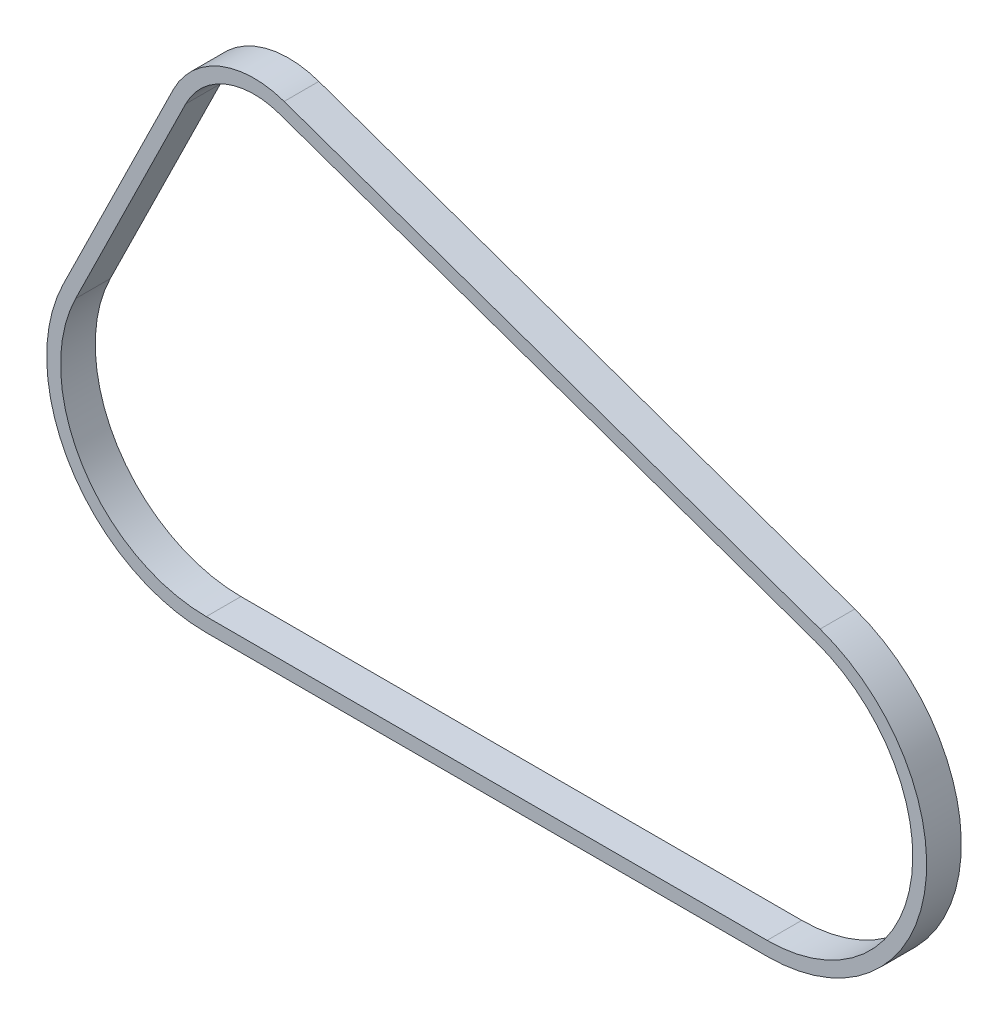
ISO-10303-21;
HEADER;
FILE_DESCRIPTION(('STEP AP214'),'2;1');
FILE_NAME('part.step','',(''),(''),'','','');
FILE_SCHEMA(('AUTOMOTIVE_DESIGN { 1 0 10303 214 1 1 1 1 }'));
ENDSEC;
DATA;
#1=APPLICATION_CONTEXT('core data for automotive mechanical design processes');
#2=APPLICATION_PROTOCOL_DEFINITION('international standard','automotive_design',2000,#1);
#3=PRODUCT_CONTEXT('',#1,'mechanical');
#4=PRODUCT('Part','Part','',(#3));
#5=PRODUCT_RELATED_PRODUCT_CATEGORY('part','',(#4));
#6=PRODUCT_DEFINITION_FORMATION('','',#4);
#7=PRODUCT_DEFINITION_CONTEXT('part definition',#1,'design');
#8=PRODUCT_DEFINITION('design','',#6,#7);
#9=PRODUCT_DEFINITION_SHAPE('','',#8);
#10=(LENGTH_UNIT() NAMED_UNIT(*) SI_UNIT(.MILLI.,.METRE.));
#11=(NAMED_UNIT(*) PLANE_ANGLE_UNIT() SI_UNIT($,.RADIAN.));
#12=(NAMED_UNIT(*) SI_UNIT($,.STERADIAN.) SOLID_ANGLE_UNIT());
#13=UNCERTAINTY_MEASURE_WITH_UNIT(LENGTH_MEASURE(1.E-05),#10,'distance_accuracy_value','');
#14=(GEOMETRIC_REPRESENTATION_CONTEXT(3) GLOBAL_UNCERTAINTY_ASSIGNED_CONTEXT((#13)) GLOBAL_UNIT_ASSIGNED_CONTEXT((#10,
#11,#12)) REPRESENTATION_CONTEXT('',''));
#15=CARTESIAN_POINT('',(0.,0.,0.));
#16=DIRECTION('',(0.,0.,1.));
#17=DIRECTION('',(1.,0.,0.));
#18=AXIS2_PLACEMENT_3D('',#15,#16,#17);
#19=CARTESIAN_POINT('',(0.,0.,-7.5));
#20=DIRECTION('',(0.,0.,1.));
#21=DIRECTION('',(1.,0.,0.));
#22=AXIS2_PLACEMENT_3D('',#19,#20,#21);
#23=CYLINDRICAL_SURFACE('',#22,39.);
#24=DIRECTION('',(0.,0.,1.));
#25=VECTOR('',#24,1.);
#26=CARTESIAN_POINT('',(-34.9896953567764,17.2255977788865,-7.5));
#27=LINE('',#26,#25);
#28=CARTESIAN_POINT('',(-34.9896953567764,17.2255977788865,-7.5));
#29=VERTEX_POINT('',#28);
#30=CARTESIAN_POINT('',(-34.9896953567764,17.2255977788865,7.5));
#31=VERTEX_POINT('',#30);
#32=EDGE_CURVE('E110',#29,#31,#27,.T.);
#33=ORIENTED_EDGE('',*,*,#32,.T.);
#34=CARTESIAN_POINT('',(0.,0.,7.5));
#35=DIRECTION('',(0.,0.,1.));
#36=DIRECTION('',(1.,0.,0.));
#37=AXIS2_PLACEMENT_3D('',#34,#35,#36);
#38=CIRCLE('',#37,39.);
#39=CARTESIAN_POINT('',(12.965481958583,36.78173837085,7.49999999999999));
#40=VERTEX_POINT('',#39);
#41=EDGE_CURVE('E233',#40,#31,#38,.T.);
#42=ORIENTED_EDGE('',*,*,#41,.F.);
#43=DIRECTION('',(0.,0.,1.));
#44=VECTOR('',#43,1.);
#45=CARTESIAN_POINT('',(12.965481958583,36.78173837085,-7.50000000000001));
#46=LINE('',#45,#44);
#47=CARTESIAN_POINT('',(12.965481958583,36.78173837085,-7.50000000000001));
#48=VERTEX_POINT('',#47);
#49=EDGE_CURVE('E12',#48,#40,#46,.T.);
#50=ORIENTED_EDGE('',*,*,#49,.F.);
#51=CARTESIAN_POINT('',(0.,0.,-7.5));
#52=DIRECTION('',(0.,0.,1.));
#53=DIRECTION('',(1.,0.,0.));
#54=AXIS2_PLACEMENT_3D('',#51,#52,#53);
#55=CIRCLE('',#54,39.);
#56=EDGE_CURVE('E264',#48,#29,#55,.T.);
#57=ORIENTED_EDGE('',*,*,#56,.T.);
#58=EDGE_LOOP('',(#33,#42,#50,#57));
#59=FACE_BOUND('',#58,.T.);
#60=ADVANCED_FACE('F107',(#59),#23,.T.);
#61=CARTESIAN_POINT('',(244.758005067254,-44.9246167284962,-7.5));
#62=DIRECTION('',(0.332448255348283,0.943121496688461,0.));
#63=DIRECTION('',(-0.943121496688461,0.332448255348283,0.));
#64=AXIS2_PLACEMENT_3D('',#61,#62,#63);
#65=PLANE('',#64);
#66=ORIENTED_EDGE('',*,*,#49,.T.);
#67=DIRECTION('',(-0.943121496688461,0.332448255348283,0.));
#68=VECTOR('',#67,1.);
#69=CARTESIAN_POINT('',(244.758005067254,-44.9246167284962,7.5));
#70=LINE('',#69,#68);
#71=CARTESIAN_POINT('',(244.758005067254,-44.9246167284962,7.5));
#72=VERTEX_POINT('',#71);
#73=EDGE_CURVE('E248',#72,#40,#70,.T.);
#74=ORIENTED_EDGE('',*,*,#73,.F.);
#75=DIRECTION('',(0.,0.,1.));
#76=VECTOR('',#75,1.);
#77=CARTESIAN_POINT('',(244.758005067254,-44.9246167284962,-7.5));
#78=LINE('',#77,#76);
#79=CARTESIAN_POINT('',(244.758005067254,-44.9246167284962,-7.5));
#80=VERTEX_POINT('',#79);
#81=EDGE_CURVE('E115',#80,#72,#78,.T.);
#82=ORIENTED_EDGE('',*,*,#81,.F.);
#83=DIRECTION('',(-0.943121496688461,0.332448255348283,0.));
#84=VECTOR('',#83,1.);
#85=CARTESIAN_POINT('',(244.758005067254,-44.9246167284962,-7.5));
#86=LINE('',#85,#84);
#87=EDGE_CURVE('E285',#80,#48,#86,.T.);
#88=ORIENTED_EDGE('',*,*,#87,.T.);
#89=EDGE_LOOP('',(#66,#74,#82,#88));
#90=FACE_BOUND('',#89,.T.);
#91=ADVANCED_FACE('F302',(#90),#65,.T.);
#92=CARTESIAN_POINT('',(221.819075448222,-110.,-7.5));
#93=DIRECTION('',(0.,0.,1.));
#94=DIRECTION('',(1.,0.,0.));
#95=AXIS2_PLACEMENT_3D('',#92,#93,#94);
#96=CYLINDRICAL_SURFACE('',#95,69.);
#97=ORIENTED_EDGE('',*,*,#81,.T.);
#98=CARTESIAN_POINT('',(221.819075448222,-110.,7.5));
#99=DIRECTION('',(0.,0.,1.));
#100=DIRECTION('',(1.,0.,0.));
#101=AXIS2_PLACEMENT_3D('',#98,#99,#100);
#102=CIRCLE('',#101,69.);
#103=CARTESIAN_POINT('',(221.819075448222,-179.,7.5));
#104=VERTEX_POINT('',#103);
#105=EDGE_CURVE('E245',#104,#72,#102,.T.);
#106=ORIENTED_EDGE('',*,*,#105,.F.);
#107=DIRECTION('',(0.,0.,1.));
#108=VECTOR('',#107,1.);
#109=CARTESIAN_POINT('',(221.819075448222,-179.,-7.5));
#110=LINE('',#109,#108);
#111=CARTESIAN_POINT('',(221.819075448222,-179.,-7.5));
#112=VERTEX_POINT('',#111);
#113=EDGE_CURVE('E289',#112,#104,#110,.T.);
#114=ORIENTED_EDGE('',*,*,#113,.F.);
#115=CARTESIAN_POINT('',(221.819075448222,-110.,-7.5));
#116=DIRECTION('',(0.,0.,1.));
#117=DIRECTION('',(1.,0.,0.));
#118=AXIS2_PLACEMENT_3D('',#115,#116,#117);
#119=CIRCLE('',#118,69.);
#120=EDGE_CURVE('E282',#112,#80,#119,.T.);
#121=ORIENTED_EDGE('',*,*,#120,.T.);
#122=EDGE_LOOP('',(#97,#106,#114,#121));
#123=FACE_BOUND('',#122,.T.);
#124=ADVANCED_FACE('F315',(#123),#96,.T.);
#125=CARTESIAN_POINT('',(-20.7151205029609,-179.,-7.5));
#126=DIRECTION('',(0.,-1.,0.));
#127=DIRECTION('',(0.,0.,-1.));
#128=AXIS2_PLACEMENT_3D('',#125,#126,#127);
#129=PLANE('',#128);
#130=ORIENTED_EDGE('',*,*,#113,.T.);
#131=DIRECTION('',(1.,0.,0.));
#132=VECTOR('',#131,1.);
#133=CARTESIAN_POINT('',(-20.7151205029609,-179.,7.5));
#134=LINE('',#133,#132);
#135=CARTESIAN_POINT('',(-20.7151205029609,-179.,7.5));
#136=VERTEX_POINT('',#135);
#137=EDGE_CURVE('E242',#136,#104,#134,.T.);
#138=ORIENTED_EDGE('',*,*,#137,.F.);
#139=DIRECTION('',(0.,0.,1.));
#140=VECTOR('',#139,1.);
#141=CARTESIAN_POINT('',(-20.7151205029609,-179.,-7.5));
#142=LINE('',#141,#140);
#143=CARTESIAN_POINT('',(-20.7151205029609,-179.,-7.5));
#144=VERTEX_POINT('',#143);
#145=EDGE_CURVE('E291',#144,#136,#142,.T.);
#146=ORIENTED_EDGE('',*,*,#145,.F.);
#147=DIRECTION('',(1.,0.,0.));
#148=VECTOR('',#147,1.);
#149=CARTESIAN_POINT('',(-20.7151205029609,-179.,-7.5));
#150=LINE('',#149,#148);
#151=EDGE_CURVE('E279',#144,#112,#150,.T.);
#152=ORIENTED_EDGE('',*,*,#151,.T.);
#153=EDGE_LOOP('',(#130,#138,#146,#152));
#154=FACE_BOUND('',#153,.T.);
#155=ADVANCED_FACE('F313',(#154),#129,.T.);
#156=CARTESIAN_POINT('',(-20.7151205029609,-110.,-7.5));
#157=DIRECTION('',(0.,0.,1.));
#158=DIRECTION('',(1.,0.,0.));
#159=AXIS2_PLACEMENT_3D('',#156,#157,#158);
#160=CYLINDRICAL_SURFACE('',#159,69.);
#161=ORIENTED_EDGE('',*,*,#145,.T.);
#162=CARTESIAN_POINT('',(-20.7151205029609,-110.,7.5));
#163=DIRECTION('',(0.,0.,1.));
#164=DIRECTION('',(1.,0.,0.));
#165=AXIS2_PLACEMENT_3D('',#162,#163,#164);
#166=CIRCLE('',#165,69.);
#167=CARTESIAN_POINT('',(-82.6199661341808,-79.5239423912008,7.5));
#168=VERTEX_POINT('',#167);
#169=EDGE_CURVE('E239',#168,#136,#166,.T.);
#170=ORIENTED_EDGE('',*,*,#169,.F.);
#171=DIRECTION('',(0.,0.,1.));
#172=VECTOR('',#171,1.);
#173=CARTESIAN_POINT('',(-82.6199661341808,-79.5239423912008,-7.5));
#174=LINE('',#173,#172);
#175=CARTESIAN_POINT('',(-82.6199661341808,-79.5239423912008,-7.5));
#176=VERTEX_POINT('',#175);
#177=EDGE_CURVE('E292',#176,#168,#174,.T.);
#178=ORIENTED_EDGE('',*,*,#177,.F.);
#179=CARTESIAN_POINT('',(-20.7151205029609,-110.,-7.5));
#180=DIRECTION('',(0.,0.,1.));
#181=DIRECTION('',(1.,0.,0.));
#182=AXIS2_PLACEMENT_3D('',#179,#180,#181);
#183=CIRCLE('',#182,69.);
#184=EDGE_CURVE('E276',#176,#144,#183,.T.);
#185=ORIENTED_EDGE('',*,*,#184,.T.);
#186=EDGE_LOOP('',(#161,#170,#178,#185));
#187=FACE_BOUND('',#186,.T.);
#188=ADVANCED_FACE('F310',(#187),#160,.T.);
#189=CARTESIAN_POINT('',(-34.9896953567764,17.2255977788865,-7.5));
#190=DIRECTION('',(-0.897171675814779,0.441681994330423,0.));
#191=DIRECTION('',(-0.441681994330424,-0.89717167581478,0.));
#192=AXIS2_PLACEMENT_3D('',#189,#190,#191);
#193=PLANE('',#192);
#194=ORIENTED_EDGE('',*,*,#177,.T.);
#195=DIRECTION('',(-0.441681994330424,-0.89717167581478,0.));
#196=VECTOR('',#195,1.);
#197=CARTESIAN_POINT('',(-34.9896953567764,17.2255977788865,7.5));
#198=LINE('',#197,#196);
#199=EDGE_CURVE('E236',#31,#168,#198,.T.);
#200=ORIENTED_EDGE('',*,*,#199,.F.);
#201=ORIENTED_EDGE('',*,*,#32,.F.);
#202=DIRECTION('',(-0.441681994330424,-0.89717167581478,0.));
#203=VECTOR('',#202,1.);
#204=CARTESIAN_POINT('',(-34.9896953567764,17.2255977788865,-7.5));
#205=LINE('',#204,#203);
#206=EDGE_CURVE('E273',#29,#176,#205,.T.);
#207=ORIENTED_EDGE('',*,*,#206,.T.);
#208=EDGE_LOOP('',(#194,#200,#201,#207));
#209=FACE_BOUND('',#208,.T.);
#210=ADVANCED_FACE('F296',(#209),#193,.T.);
#211=CARTESIAN_POINT('',(0.,0.,-7.5));
#212=DIRECTION('',(0.,0.,1.));
#213=DIRECTION('',(1.,0.,0.));
#214=AXIS2_PLACEMENT_3D('',#211,#212,#213);
#215=PLANE('',#214);
#216=DIRECTION('',(-0.943121496688461,0.332448255348283,0.));
#217=VECTOR('',#216,1.);
#218=CARTESIAN_POINT('',(242.763315535164,-50.5833457086269,-7.5));
#219=LINE('',#218,#217);
#220=CARTESIAN_POINT('',(242.763315535164,-50.5833457086269,-7.5));
#221=VERTEX_POINT('',#220);
#222=CARTESIAN_POINT('',(10.9707924264934,31.1230093907192,-7.5));
#223=VERTEX_POINT('',#222);
#224=EDGE_CURVE('E208',#221,#223,#219,.T.);
#225=ORIENTED_EDGE('',*,*,#224,.T.);
#226=CARTESIAN_POINT('',(0.,0.,-7.5));
#227=DIRECTION('',(0.,0.,1.));
#228=DIRECTION('',(1.,0.,0.));
#229=AXIS2_PLACEMENT_3D('',#226,#227,#228);
#230=CIRCLE('',#229,33.);
#231=CARTESIAN_POINT('',(-29.6066653018877,14.575505812904,-7.5));
#232=VERTEX_POINT('',#231);
#233=EDGE_CURVE('E251',#223,#232,#230,.T.);
#234=ORIENTED_EDGE('',*,*,#233,.T.);
#235=DIRECTION('',(-0.441681994330423,-0.89717167581478,0.));
#236=VECTOR('',#235,1.);
#237=CARTESIAN_POINT('',(-29.6066653018877,14.575505812904,-7.5));
#238=LINE('',#237,#236);
#239=CARTESIAN_POINT('',(-77.2369360792921,-82.1740343571833,-7.5));
#240=VERTEX_POINT('',#239);
#241=EDGE_CURVE('E203',#232,#240,#238,.T.);
#242=ORIENTED_EDGE('',*,*,#241,.T.);
#243=CARTESIAN_POINT('',(-20.7151205029609,-110.,-7.5));
#244=DIRECTION('',(0.,0.,1.));
#245=DIRECTION('',(1.,0.,0.));
#246=AXIS2_PLACEMENT_3D('',#243,#244,#245);
#247=CIRCLE('',#246,63.);
#248=CARTESIAN_POINT('',(-20.7151205029609,-173.,-7.5));
#249=VERTEX_POINT('',#248);
#250=EDGE_CURVE('E123',#240,#249,#247,.T.);
#251=ORIENTED_EDGE('',*,*,#250,.T.);
#252=DIRECTION('',(1.,0.,0.));
#253=VECTOR('',#252,1.);
#254=CARTESIAN_POINT('',(-20.7151205029609,-173.,-7.5));
#255=LINE('',#254,#253);
#256=CARTESIAN_POINT('',(221.819075448222,-173.,-7.5));
#257=VERTEX_POINT('',#256);
#258=EDGE_CURVE('E255',#249,#257,#255,.T.);
#259=ORIENTED_EDGE('',*,*,#258,.T.);
#260=CARTESIAN_POINT('',(221.819075448222,-110.,-7.5));
#261=DIRECTION('',(0.,0.,1.));
#262=DIRECTION('',(1.,0.,0.));
#263=AXIS2_PLACEMENT_3D('',#260,#261,#262);
#264=CIRCLE('',#263,63.);
#265=EDGE_CURVE('E258',#257,#221,#264,.T.);
#266=ORIENTED_EDGE('',*,*,#265,.T.);
#267=EDGE_LOOP('',(#225,#234,#242,#251,#259,#266));
#268=FACE_BOUND('',#267,.T.);
#269=ORIENTED_EDGE('',*,*,#56,.F.);
#270=ORIENTED_EDGE('',*,*,#87,.F.);
#271=ORIENTED_EDGE('',*,*,#120,.F.);
#272=ORIENTED_EDGE('',*,*,#151,.F.);
#273=ORIENTED_EDGE('',*,*,#184,.F.);
#274=ORIENTED_EDGE('',*,*,#206,.F.);
#275=EDGE_LOOP('',(#269,#270,#271,#272,#273,#274));
#276=FACE_BOUND('',#275,.T.);
#277=ADVANCED_FACE('F306',(#268,#276),#215,.F.);
#278=CARTESIAN_POINT('',(0.,0.,-7.5));
#279=DIRECTION('',(0.,0.,1.));
#280=DIRECTION('',(1.,0.,0.));
#281=AXIS2_PLACEMENT_3D('',#278,#279,#280);
#282=CYLINDRICAL_SURFACE('',#281,33.);
#283=DIRECTION('',(0.,0.,1.));
#284=VECTOR('',#283,1.);
#285=CARTESIAN_POINT('',(10.9707924264934,31.1230093907192,-7.5));
#286=LINE('',#285,#284);
#287=CARTESIAN_POINT('',(10.9707924264934,31.1230093907192,7.5));
#288=VERTEX_POINT('',#287);
#289=EDGE_CURVE('E213',#223,#288,#286,.T.);
#290=ORIENTED_EDGE('',*,*,#289,.T.);
#291=CARTESIAN_POINT('',(0.,0.,7.5));
#292=DIRECTION('',(0.,0.,1.));
#293=DIRECTION('',(1.,0.,0.));
#294=AXIS2_PLACEMENT_3D('',#291,#292,#293);
#295=CIRCLE('',#294,33.);
#296=CARTESIAN_POINT('',(-29.6066653018877,14.575505812904,7.5));
#297=VERTEX_POINT('',#296);
#298=EDGE_CURVE('E211',#288,#297,#295,.T.);
#299=ORIENTED_EDGE('',*,*,#298,.T.);
#300=DIRECTION('',(0.,0.,1.));
#301=VECTOR('',#300,1.);
#302=CARTESIAN_POINT('',(-29.6066653018877,14.575505812904,-7.5));
#303=LINE('',#302,#301);
#304=EDGE_CURVE('E196',#232,#297,#303,.T.);
#305=ORIENTED_EDGE('',*,*,#304,.F.);
#306=ORIENTED_EDGE('',*,*,#233,.F.);
#307=EDGE_LOOP('',(#290,#299,#305,#306));
#308=FACE_BOUND('',#307,.T.);
#309=ADVANCED_FACE('F212',(#308),#282,.F.);
#310=CARTESIAN_POINT('',(242.763315535164,-50.5833457086269,-7.5));
#311=DIRECTION('',(0.332448255348283,0.943121496688461,0.));
#312=DIRECTION('',(-0.943121496688461,0.332448255348283,0.));
#313=AXIS2_PLACEMENT_3D('',#310,#311,#312);
#314=PLANE('',#313);
#315=DIRECTION('',(0.,0.,1.));
#316=VECTOR('',#315,1.);
#317=CARTESIAN_POINT('',(242.763315535164,-50.5833457086269,-7.5));
#318=LINE('',#317,#316);
#319=CARTESIAN_POINT('',(242.763315535164,-50.5833457086269,7.5));
#320=VERTEX_POINT('',#319);
#321=EDGE_CURVE('E265',#221,#320,#318,.T.);
#322=ORIENTED_EDGE('',*,*,#321,.T.);
#323=DIRECTION('',(-0.943121496688461,0.332448255348283,0.));
#324=VECTOR('',#323,1.);
#325=CARTESIAN_POINT('',(242.763315535164,-50.5833457086269,7.5));
#326=LINE('',#325,#324);
#327=EDGE_CURVE('E231',#320,#288,#326,.T.);
#328=ORIENTED_EDGE('',*,*,#327,.T.);
#329=ORIENTED_EDGE('',*,*,#289,.F.);
#330=ORIENTED_EDGE('',*,*,#224,.F.);
#331=EDGE_LOOP('',(#322,#328,#329,#330));
#332=FACE_BOUND('',#331,.T.);
#333=ADVANCED_FACE('F374',(#332),#314,.F.);
#334=CARTESIAN_POINT('',(221.819075448222,-110.,-7.5));
#335=DIRECTION('',(0.,0.,1.));
#336=DIRECTION('',(1.,0.,0.));
#337=AXIS2_PLACEMENT_3D('',#334,#335,#336);
#338=CYLINDRICAL_SURFACE('',#337,63.);
#339=DIRECTION('',(0.,0.,1.));
#340=VECTOR('',#339,1.);
#341=CARTESIAN_POINT('',(221.819075448222,-173.,-7.5));
#342=LINE('',#341,#340);
#343=CARTESIAN_POINT('',(221.819075448222,-173.,7.5));
#344=VERTEX_POINT('',#343);
#345=EDGE_CURVE('E267',#257,#344,#342,.T.);
#346=ORIENTED_EDGE('',*,*,#345,.T.);
#347=CARTESIAN_POINT('',(221.819075448222,-110.,7.5));
#348=DIRECTION('',(0.,0.,1.));
#349=DIRECTION('',(1.,0.,0.));
#350=AXIS2_PLACEMENT_3D('',#347,#348,#349);
#351=CIRCLE('',#350,63.);
#352=EDGE_CURVE('E228',#344,#320,#351,.T.);
#353=ORIENTED_EDGE('',*,*,#352,.T.);
#354=ORIENTED_EDGE('',*,*,#321,.F.);
#355=ORIENTED_EDGE('',*,*,#265,.F.);
#356=EDGE_LOOP('',(#346,#353,#354,#355));
#357=FACE_BOUND('',#356,.T.);
#358=ADVANCED_FACE('F383',(#357),#338,.F.);
#359=CARTESIAN_POINT('',(-20.7151205029609,-173.,-7.5));
#360=DIRECTION('',(0.,-1.,0.));
#361=DIRECTION('',(0.,0.,-1.));
#362=AXIS2_PLACEMENT_3D('',#359,#360,#361);
#363=PLANE('',#362);
#364=DIRECTION('',(0.,0.,1.));
#365=VECTOR('',#364,1.);
#366=CARTESIAN_POINT('',(-20.7151205029609,-173.,-7.5));
#367=LINE('',#366,#365);
#368=CARTESIAN_POINT('',(-20.7151205029609,-173.,7.5));
#369=VERTEX_POINT('',#368);
#370=EDGE_CURVE('E269',#249,#369,#367,.T.);
#371=ORIENTED_EDGE('',*,*,#370,.T.);
#372=DIRECTION('',(1.,0.,0.));
#373=VECTOR('',#372,1.);
#374=CARTESIAN_POINT('',(-20.7151205029609,-173.,7.5));
#375=LINE('',#374,#373);
#376=EDGE_CURVE('E223',#369,#344,#375,.T.);
#377=ORIENTED_EDGE('',*,*,#376,.T.);
#378=ORIENTED_EDGE('',*,*,#345,.F.);
#379=ORIENTED_EDGE('',*,*,#258,.F.);
#380=EDGE_LOOP('',(#371,#377,#378,#379));
#381=FACE_BOUND('',#380,.T.);
#382=ADVANCED_FACE('F393',(#381),#363,.F.);
#383=CARTESIAN_POINT('',(-20.7151205029609,-110.,-7.5));
#384=DIRECTION('',(0.,0.,1.));
#385=DIRECTION('',(1.,0.,0.));
#386=AXIS2_PLACEMENT_3D('',#383,#384,#385);
#387=CYLINDRICAL_SURFACE('',#386,63.);
#388=DIRECTION('',(0.,0.,1.));
#389=VECTOR('',#388,1.);
#390=CARTESIAN_POINT('',(-77.2369360792921,-82.1740343571833,-7.5));
#391=LINE('',#390,#389);
#392=CARTESIAN_POINT('',(-77.2369360792921,-82.1740343571833,7.5));
#393=VERTEX_POINT('',#392);
#394=EDGE_CURVE('E207',#240,#393,#391,.T.);
#395=ORIENTED_EDGE('',*,*,#394,.T.);
#396=CARTESIAN_POINT('',(-20.7151205029609,-110.,7.5));
#397=DIRECTION('',(0.,0.,1.));
#398=DIRECTION('',(1.,0.,0.));
#399=AXIS2_PLACEMENT_3D('',#396,#397,#398);
#400=CIRCLE('',#399,63.);
#401=EDGE_CURVE('E221',#393,#369,#400,.T.);
#402=ORIENTED_EDGE('',*,*,#401,.T.);
#403=ORIENTED_EDGE('',*,*,#370,.F.);
#404=ORIENTED_EDGE('',*,*,#250,.F.);
#405=EDGE_LOOP('',(#395,#402,#403,#404));
#406=FACE_BOUND('',#405,.T.);
#407=ADVANCED_FACE('F403',(#406),#387,.F.);
#408=CARTESIAN_POINT('',(-29.6066653018877,14.575505812904,-7.5));
#409=DIRECTION('',(-0.89717167581478,0.441681994330423,0.));
#410=DIRECTION('',(-0.441681994330423,-0.89717167581478,0.));
#411=AXIS2_PLACEMENT_3D('',#408,#409,#410);
#412=PLANE('',#411);
#413=ORIENTED_EDGE('',*,*,#304,.T.);
#414=DIRECTION('',(-0.441681994330423,-0.89717167581478,0.));
#415=VECTOR('',#414,1.);
#416=CARTESIAN_POINT('',(-29.6066653018877,14.575505812904,7.5));
#417=LINE('',#416,#415);
#418=EDGE_CURVE('E200',#297,#393,#417,.T.);
#419=ORIENTED_EDGE('',*,*,#418,.T.);
#420=ORIENTED_EDGE('',*,*,#394,.F.);
#421=ORIENTED_EDGE('',*,*,#241,.F.);
#422=EDGE_LOOP('',(#413,#419,#420,#421));
#423=FACE_BOUND('',#422,.T.);
#424=ADVANCED_FACE('F198',(#423),#412,.F.);
#425=CARTESIAN_POINT('',(0.,0.,7.5));
#426=DIRECTION('',(0.,0.,1.));
#427=DIRECTION('',(1.,0.,0.));
#428=AXIS2_PLACEMENT_3D('',#425,#426,#427);
#429=PLANE('',#428);
#430=ORIENTED_EDGE('',*,*,#41,.T.);
#431=ORIENTED_EDGE('',*,*,#199,.T.);
#432=ORIENTED_EDGE('',*,*,#169,.T.);
#433=ORIENTED_EDGE('',*,*,#137,.T.);
#434=ORIENTED_EDGE('',*,*,#105,.T.);
#435=ORIENTED_EDGE('',*,*,#73,.T.);
#436=EDGE_LOOP('',(#430,#431,#432,#433,#434,#435));
#437=FACE_BOUND('',#436,.T.);
#438=ORIENTED_EDGE('',*,*,#418,.F.);
#439=ORIENTED_EDGE('',*,*,#298,.F.);
#440=ORIENTED_EDGE('',*,*,#327,.F.);
#441=ORIENTED_EDGE('',*,*,#352,.F.);
#442=ORIENTED_EDGE('',*,*,#376,.F.);
#443=ORIENTED_EDGE('',*,*,#401,.F.);
#444=EDGE_LOOP('',(#438,#439,#440,#441,#442,#443));
#445=FACE_BOUND('',#444,.T.);
#446=ADVANCED_FACE('F218',(#437,#445),#429,.T.);
#447=CLOSED_SHELL('',(#60,#91,#124,#155,#188,#210,#277,#309,#333,#358,#382,#407,#424,#446));
#448=MANIFOLD_SOLID_BREP('B2',#447);
#449=ADVANCED_BREP_SHAPE_REPRESENTATION('',(#18,#448),#14);
#450=SHAPE_DEFINITION_REPRESENTATION(#9,#449);
ENDSEC;
END-ISO-10303-21;
